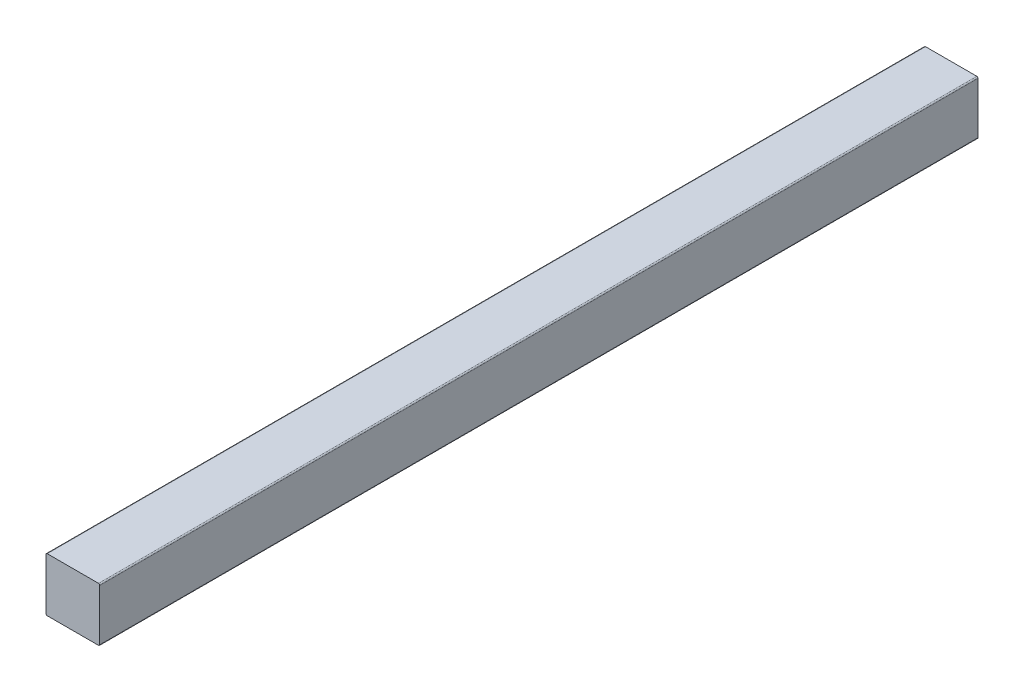
ISO-10303-21;
HEADER;
FILE_DESCRIPTION(('STEP AP214'),'2;1');
FILE_NAME('part.step','',(''),(''),'','','');
FILE_SCHEMA(('AUTOMOTIVE_DESIGN { 1 0 10303 214 1 1 1 1 }'));
ENDSEC;
DATA;
#1=APPLICATION_CONTEXT('core data for automotive mechanical design processes');
#2=APPLICATION_PROTOCOL_DEFINITION('international standard','automotive_design',2000,#1);
#3=PRODUCT_CONTEXT('',#1,'mechanical');
#4=PRODUCT('Part','Part','',(#3));
#5=PRODUCT_RELATED_PRODUCT_CATEGORY('part','',(#4));
#6=PRODUCT_DEFINITION_FORMATION('','',#4);
#7=PRODUCT_DEFINITION_CONTEXT('part definition',#1,'design');
#8=PRODUCT_DEFINITION('design','',#6,#7);
#9=PRODUCT_DEFINITION_SHAPE('','',#8);
#10=(LENGTH_UNIT() NAMED_UNIT(*) SI_UNIT(.MILLI.,.METRE.));
#11=(NAMED_UNIT(*) PLANE_ANGLE_UNIT() SI_UNIT($,.RADIAN.));
#12=(NAMED_UNIT(*) SI_UNIT($,.STERADIAN.) SOLID_ANGLE_UNIT());
#13=UNCERTAINTY_MEASURE_WITH_UNIT(LENGTH_MEASURE(1.E-05),#10,'distance_accuracy_value','');
#14=(GEOMETRIC_REPRESENTATION_CONTEXT(3) GLOBAL_UNCERTAINTY_ASSIGNED_CONTEXT((#13)) GLOBAL_UNIT_ASSIGNED_CONTEXT((#10,
#11,#12)) REPRESENTATION_CONTEXT('',''));
#15=CARTESIAN_POINT('',(0.,0.,0.));
#16=DIRECTION('',(0.,0.,1.));
#17=DIRECTION('',(1.,0.,0.));
#18=AXIS2_PLACEMENT_3D('',#15,#16,#17);
#19=CARTESIAN_POINT('',(1.,10.,719.));
#20=DIRECTION('',(1.,0.,0.));
#21=DIRECTION('',(0.,1.,0.));
#22=AXIS2_PLACEMENT_3D('',#19,#20,#21);
#23=PLANE('',#22);
#24=DIRECTION('',(0.,-1.,0.));
#25=VECTOR('',#24,1.);
#26=CARTESIAN_POINT('',(1.,10.,0.));
#27=LINE('',#26,#25);
#28=CARTESIAN_POINT('',(1.,9.00000000000001,0.));
#29=VERTEX_POINT('',#28);
#30=CARTESIAN_POINT('',(1.,-33.,0.));
#31=VERTEX_POINT('',#30);
#32=EDGE_CURVE('E143',#29,#31,#27,.T.);
#33=ORIENTED_EDGE('',*,*,#32,.T.);
#34=DIRECTION('',(0.,0.,-1.));
#35=VECTOR('',#34,1.);
#36=CARTESIAN_POINT('',(1.,-33.,719.));
#37=LINE('',#36,#35);
#38=CARTESIAN_POINT('',(1.,-33.,719.));
#39=VERTEX_POINT('',#38);
#40=EDGE_CURVE('E118',#31,#39,#37,.F.);
#41=ORIENTED_EDGE('',*,*,#40,.T.);
#42=DIRECTION('',(0.,-1.,0.));
#43=VECTOR('',#42,1.);
#44=CARTESIAN_POINT('',(1.,10.,719.));
#45=LINE('',#44,#43);
#46=CARTESIAN_POINT('',(1.,9.00000000000001,719.));
#47=VERTEX_POINT('',#46);
#48=EDGE_CURVE('E157',#47,#39,#45,.T.);
#49=ORIENTED_EDGE('',*,*,#48,.F.);
#50=DIRECTION('',(0.,0.,-1.));
#51=VECTOR('',#50,1.);
#52=CARTESIAN_POINT('',(1.,9.00000000000001,719.));
#53=LINE('',#52,#51);
#54=EDGE_CURVE('E124',#47,#29,#53,.T.);
#55=ORIENTED_EDGE('',*,*,#54,.T.);
#56=EDGE_LOOP('',(#33,#41,#49,#55));
#57=FACE_BOUND('',#56,.T.);
#58=ADVANCED_FACE('F47',(#57),#23,.F.);
#59=CARTESIAN_POINT('',(1.,-34.,719.));
#60=DIRECTION('',(0.,1.,0.));
#61=DIRECTION('',(0.,0.,1.));
#62=AXIS2_PLACEMENT_3D('',#59,#60,#61);
#63=PLANE('',#62);
#64=DIRECTION('',(1.,0.,0.));
#65=VECTOR('',#64,1.);
#66=CARTESIAN_POINT('',(1.,-34.,719.));
#67=LINE('',#66,#65);
#68=CARTESIAN_POINT('',(2.,-34.,719.));
#69=VERTEX_POINT('',#68);
#70=CARTESIAN_POINT('',(44.,-34.,719.));
#71=VERTEX_POINT('',#70);
#72=EDGE_CURVE('E134',#69,#71,#67,.T.);
#73=ORIENTED_EDGE('',*,*,#72,.F.);
#74=DIRECTION('',(0.,0.,-1.));
#75=VECTOR('',#74,1.);
#76=CARTESIAN_POINT('',(2.,-34.,719.));
#77=LINE('',#76,#75);
#78=CARTESIAN_POINT('',(2.,-34.,0.));
#79=VERTEX_POINT('',#78);
#80=EDGE_CURVE('E117',#69,#79,#77,.T.);
#81=ORIENTED_EDGE('',*,*,#80,.T.);
#82=DIRECTION('',(1.,0.,0.));
#83=VECTOR('',#82,1.);
#84=CARTESIAN_POINT('',(1.,-34.,0.));
#85=LINE('',#84,#83);
#86=CARTESIAN_POINT('',(44.,-34.,0.));
#87=VERTEX_POINT('',#86);
#88=EDGE_CURVE('E131',#79,#87,#85,.T.);
#89=ORIENTED_EDGE('',*,*,#88,.T.);
#90=DIRECTION('',(0.,0.,-1.));
#91=VECTOR('',#90,1.);
#92=CARTESIAN_POINT('',(44.,-34.,719.));
#93=LINE('',#92,#91);
#94=EDGE_CURVE('E137',#87,#71,#93,.F.);
#95=ORIENTED_EDGE('',*,*,#94,.T.);
#96=EDGE_LOOP('',(#73,#81,#89,#95));
#97=FACE_BOUND('',#96,.T.);
#98=ADVANCED_FACE('F130',(#97),#63,.F.);
#99=CARTESIAN_POINT('',(45.,10.,719.));
#100=DIRECTION('',(-1.,0.,0.));
#101=DIRECTION('',(0.,-1.,0.));
#102=AXIS2_PLACEMENT_3D('',#99,#100,#101);
#103=PLANE('',#102);
#104=DIRECTION('',(0.,1.,0.));
#105=VECTOR('',#104,1.);
#106=CARTESIAN_POINT('',(45.,10.,719.));
#107=LINE('',#106,#105);
#108=CARTESIAN_POINT('',(45.,-33.,719.));
#109=VERTEX_POINT('',#108);
#110=CARTESIAN_POINT('',(45.,9.00000000000001,719.));
#111=VERTEX_POINT('',#110);
#112=EDGE_CURVE('E210',#109,#111,#107,.T.);
#113=ORIENTED_EDGE('',*,*,#112,.F.);
#114=DIRECTION('',(0.,0.,-1.));
#115=VECTOR('',#114,1.);
#116=CARTESIAN_POINT('',(45.,-33.,719.));
#117=LINE('',#116,#115);
#118=CARTESIAN_POINT('',(45.,-33.,0.));
#119=VERTEX_POINT('',#118);
#120=EDGE_CURVE('E187',#109,#119,#117,.T.);
#121=ORIENTED_EDGE('',*,*,#120,.T.);
#122=DIRECTION('',(0.,1.,0.));
#123=VECTOR('',#122,1.);
#124=CARTESIAN_POINT('',(45.,10.,0.));
#125=LINE('',#124,#123);
#126=CARTESIAN_POINT('',(45.,9.00000000000001,0.));
#127=VERTEX_POINT('',#126);
#128=EDGE_CURVE('E142',#119,#127,#125,.T.);
#129=ORIENTED_EDGE('',*,*,#128,.T.);
#130=DIRECTION('',(0.,0.,-1.));
#131=VECTOR('',#130,1.);
#132=CARTESIAN_POINT('',(45.,9.00000000000001,719.));
#133=LINE('',#132,#131);
#134=EDGE_CURVE('E184',#127,#111,#133,.F.);
#135=ORIENTED_EDGE('',*,*,#134,.T.);
#136=EDGE_LOOP('',(#113,#121,#129,#135));
#137=FACE_BOUND('',#136,.T.);
#138=ADVANCED_FACE('F225',(#137),#103,.F.);
#139=CARTESIAN_POINT('',(1.,10.,719.));
#140=DIRECTION('',(0.,-1.,0.));
#141=DIRECTION('',(0.,0.,-1.));
#142=AXIS2_PLACEMENT_3D('',#139,#140,#141);
#143=PLANE('',#142);
#144=DIRECTION('',(-1.,0.,0.));
#145=VECTOR('',#144,1.);
#146=CARTESIAN_POINT('',(1.,10.,0.));
#147=LINE('',#146,#145);
#148=CARTESIAN_POINT('',(44.,10.,0.));
#149=VERTEX_POINT('',#148);
#150=CARTESIAN_POINT('',(2.,10.,0.));
#151=VERTEX_POINT('',#150);
#152=EDGE_CURVE('E150',#149,#151,#147,.T.);
#153=ORIENTED_EDGE('',*,*,#152,.T.);
#154=DIRECTION('',(0.,0.,-1.));
#155=VECTOR('',#154,1.);
#156=CARTESIAN_POINT('',(2.,10.,719.));
#157=LINE('',#156,#155);
#158=CARTESIAN_POINT('',(2.,10.,719.));
#159=VERTEX_POINT('',#158);
#160=EDGE_CURVE('E11',#151,#159,#157,.F.);
#161=ORIENTED_EDGE('',*,*,#160,.T.);
#162=DIRECTION('',(-1.,0.,0.));
#163=VECTOR('',#162,1.);
#164=CARTESIAN_POINT('',(1.,10.,719.));
#165=LINE('',#164,#163);
#166=CARTESIAN_POINT('',(44.,10.,719.));
#167=VERTEX_POINT('',#166);
#168=EDGE_CURVE('E159',#167,#159,#165,.T.);
#169=ORIENTED_EDGE('',*,*,#168,.F.);
#170=DIRECTION('',(0.,0.,-1.));
#171=VECTOR('',#170,1.);
#172=CARTESIAN_POINT('',(44.,10.,719.));
#173=LINE('',#172,#171);
#174=EDGE_CURVE('E56',#167,#149,#173,.T.);
#175=ORIENTED_EDGE('',*,*,#174,.T.);
#176=EDGE_LOOP('',(#153,#161,#169,#175));
#177=FACE_BOUND('',#176,.T.);
#178=ADVANCED_FACE('F196',(#177),#143,.F.);
#179=CARTESIAN_POINT('',(0.,0.,719.));
#180=DIRECTION('',(0.,0.,1.));
#181=DIRECTION('',(1.,0.,0.));
#182=AXIS2_PLACEMENT_3D('',#179,#180,#181);
#183=PLANE('',#182);
#184=ORIENTED_EDGE('',*,*,#48,.T.);
#185=CARTESIAN_POINT('',(2.,-33.,719.));
#186=DIRECTION('',(0.,0.,1.));
#187=DIRECTION('',(1.,0.,0.));
#188=AXIS2_PLACEMENT_3D('',#185,#186,#187);
#189=CIRCLE('',#188,0.999999999999997);
#190=EDGE_CURVE('E181',#39,#69,#189,.T.);
#191=ORIENTED_EDGE('',*,*,#190,.T.);
#192=ORIENTED_EDGE('',*,*,#72,.T.);
#193=CARTESIAN_POINT('',(44.,-33.,719.));
#194=DIRECTION('',(0.,0.,1.));
#195=DIRECTION('',(1.,0.,0.));
#196=AXIS2_PLACEMENT_3D('',#193,#194,#195);
#197=CIRCLE('',#196,0.999999999999997);
#198=EDGE_CURVE('E178',#71,#109,#197,.T.);
#199=ORIENTED_EDGE('',*,*,#198,.T.);
#200=ORIENTED_EDGE('',*,*,#112,.T.);
#201=CARTESIAN_POINT('',(44.,9.00000000000001,719.));
#202=DIRECTION('',(0.,0.,1.));
#203=DIRECTION('',(1.,0.,0.));
#204=AXIS2_PLACEMENT_3D('',#201,#202,#203);
#205=CIRCLE('',#204,0.999999999999997);
#206=EDGE_CURVE('E68',#111,#167,#205,.T.);
#207=ORIENTED_EDGE('',*,*,#206,.T.);
#208=ORIENTED_EDGE('',*,*,#168,.T.);
#209=CARTESIAN_POINT('',(2.,9.00000000000001,719.));
#210=DIRECTION('',(0.,0.,1.));
#211=DIRECTION('',(1.,0.,0.));
#212=AXIS2_PLACEMENT_3D('',#209,#210,#211);
#213=CIRCLE('',#212,0.999999999999997);
#214=EDGE_CURVE('E175',#159,#47,#213,.T.);
#215=ORIENTED_EDGE('',*,*,#214,.T.);
#216=EDGE_LOOP('',(#184,#191,#192,#199,#200,#207,#208,#215));
#217=FACE_BOUND('',#216,.T.);
#218=ADVANCED_FACE('F217',(#217),#183,.T.);
#219=CARTESIAN_POINT('',(0.,0.,0.));
#220=DIRECTION('',(0.,0.,1.));
#221=DIRECTION('',(1.,0.,0.));
#222=AXIS2_PLACEMENT_3D('',#219,#220,#221);
#223=PLANE('',#222);
#224=ORIENTED_EDGE('',*,*,#88,.F.);
#225=CARTESIAN_POINT('',(2.,-33.,0.));
#226=DIRECTION('',(0.,0.,1.));
#227=DIRECTION('',(1.,0.,0.));
#228=AXIS2_PLACEMENT_3D('',#225,#226,#227);
#229=CIRCLE('',#228,0.999999999999997);
#230=EDGE_CURVE('E113',#79,#31,#229,.F.);
#231=ORIENTED_EDGE('',*,*,#230,.T.);
#232=ORIENTED_EDGE('',*,*,#32,.F.);
#233=CARTESIAN_POINT('',(2.,9.00000000000001,0.));
#234=DIRECTION('',(0.,0.,1.));
#235=DIRECTION('',(1.,0.,0.));
#236=AXIS2_PLACEMENT_3D('',#233,#234,#235);
#237=CIRCLE('',#236,0.999999999999997);
#238=EDGE_CURVE('E163',#29,#151,#237,.F.);
#239=ORIENTED_EDGE('',*,*,#238,.T.);
#240=ORIENTED_EDGE('',*,*,#152,.F.);
#241=CARTESIAN_POINT('',(44.,9.00000000000001,0.));
#242=DIRECTION('',(0.,0.,1.));
#243=DIRECTION('',(1.,0.,0.));
#244=AXIS2_PLACEMENT_3D('',#241,#242,#243);
#245=CIRCLE('',#244,0.999999999999997);
#246=EDGE_CURVE('E136',#149,#127,#245,.F.);
#247=ORIENTED_EDGE('',*,*,#246,.T.);
#248=ORIENTED_EDGE('',*,*,#128,.F.);
#249=CARTESIAN_POINT('',(44.,-33.,0.));
#250=DIRECTION('',(0.,0.,1.));
#251=DIRECTION('',(1.,0.,0.));
#252=AXIS2_PLACEMENT_3D('',#249,#250,#251);
#253=CIRCLE('',#252,0.999999999999997);
#254=EDGE_CURVE('E125',#119,#87,#253,.F.);
#255=ORIENTED_EDGE('',*,*,#254,.T.);
#256=EDGE_LOOP('',(#224,#231,#232,#239,#240,#247,#248,#255));
#257=FACE_BOUND('',#256,.T.);
#258=ADVANCED_FACE('F139',(#257),#223,.F.);
#259=CARTESIAN_POINT('',(2.,-33.,719.));
#260=DIRECTION('',(0.,0.,-1.));
#261=DIRECTION('',(-1.,0.,0.));
#262=AXIS2_PLACEMENT_3D('',#259,#260,#261);
#263=CYLINDRICAL_SURFACE('',#262,0.999999999999997);
#264=ORIENTED_EDGE('',*,*,#190,.F.);
#265=ORIENTED_EDGE('',*,*,#40,.F.);
#266=ORIENTED_EDGE('',*,*,#230,.F.);
#267=ORIENTED_EDGE('',*,*,#80,.F.);
#268=EDGE_LOOP('',(#264,#265,#266,#267));
#269=FACE_BOUND('',#268,.T.);
#270=ADVANCED_FACE('F116',(#269),#263,.T.);
#271=CARTESIAN_POINT('',(44.,-33.,719.));
#272=DIRECTION('',(0.,0.,-1.));
#273=DIRECTION('',(-1.,0.,0.));
#274=AXIS2_PLACEMENT_3D('',#271,#272,#273);
#275=CYLINDRICAL_SURFACE('',#274,0.999999999999997);
#276=ORIENTED_EDGE('',*,*,#198,.F.);
#277=ORIENTED_EDGE('',*,*,#94,.F.);
#278=ORIENTED_EDGE('',*,*,#254,.F.);
#279=ORIENTED_EDGE('',*,*,#120,.F.);
#280=EDGE_LOOP('',(#276,#277,#278,#279));
#281=FACE_BOUND('',#280,.T.);
#282=ADVANCED_FACE('F238',(#281),#275,.T.);
#283=CARTESIAN_POINT('',(2.,9.00000000000001,719.));
#284=DIRECTION('',(0.,0.,-1.));
#285=DIRECTION('',(-1.,0.,0.));
#286=AXIS2_PLACEMENT_3D('',#283,#284,#285);
#287=CYLINDRICAL_SURFACE('',#286,0.999999999999997);
#288=ORIENTED_EDGE('',*,*,#214,.F.);
#289=ORIENTED_EDGE('',*,*,#160,.F.);
#290=ORIENTED_EDGE('',*,*,#238,.F.);
#291=ORIENTED_EDGE('',*,*,#54,.F.);
#292=EDGE_LOOP('',(#288,#289,#290,#291));
#293=FACE_BOUND('',#292,.T.);
#294=ADVANCED_FACE('F201',(#293),#287,.T.);
#295=CARTESIAN_POINT('',(44.,9.00000000000001,719.));
#296=DIRECTION('',(0.,0.,-1.));
#297=DIRECTION('',(-1.,0.,0.));
#298=AXIS2_PLACEMENT_3D('',#295,#296,#297);
#299=CYLINDRICAL_SURFACE('',#298,0.999999999999997);
#300=ORIENTED_EDGE('',*,*,#206,.F.);
#301=ORIENTED_EDGE('',*,*,#134,.F.);
#302=ORIENTED_EDGE('',*,*,#246,.F.);
#303=ORIENTED_EDGE('',*,*,#174,.F.);
#304=EDGE_LOOP('',(#300,#301,#302,#303));
#305=FACE_BOUND('',#304,.T.);
#306=ADVANCED_FACE('F49',(#305),#299,.T.);
#307=CLOSED_SHELL('',(#58,#98,#138,#178,#218,#258,#270,#282,#294,#306));
#308=MANIFOLD_SOLID_BREP('B2',#307);
#309=ADVANCED_BREP_SHAPE_REPRESENTATION('',(#18,#308),#14);
#310=SHAPE_DEFINITION_REPRESENTATION(#9,#309);
ENDSEC;
END-ISO-10303-21;
